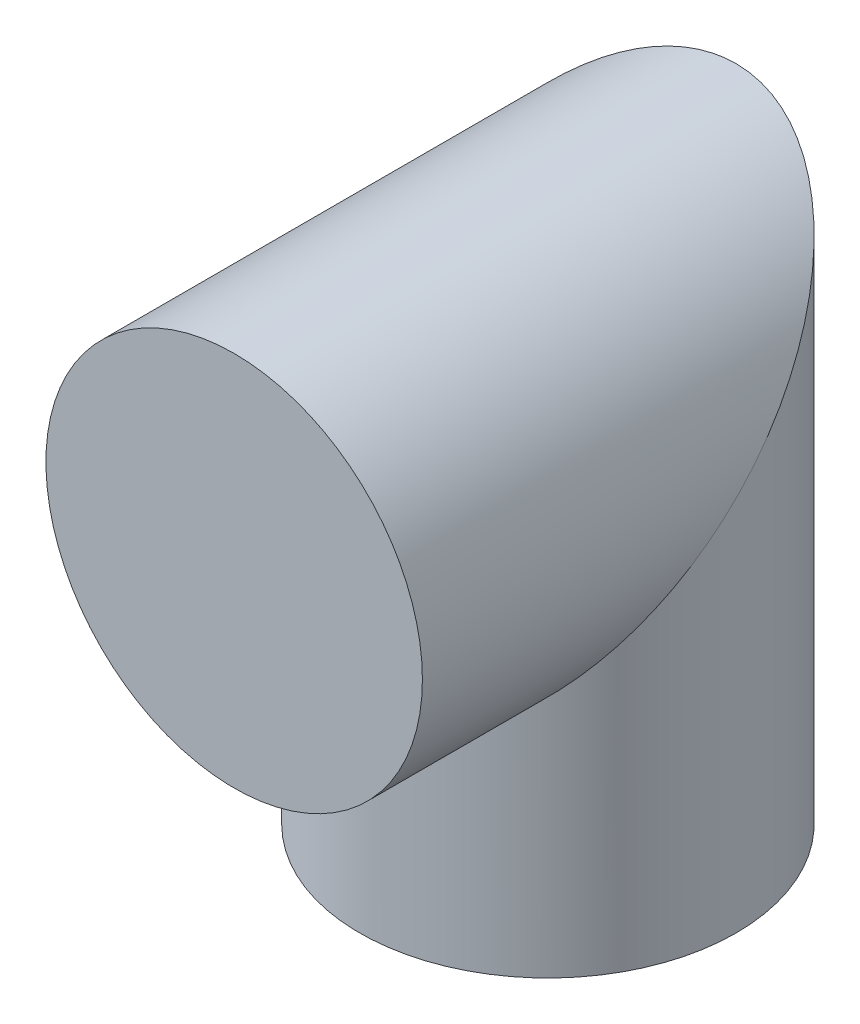
ISO-10303-21;
HEADER;
FILE_DESCRIPTION(('STEP AP214'),'2;1');
FILE_NAME('part.step','',(''),(''),'','','');
FILE_SCHEMA(('AUTOMOTIVE_DESIGN { 1 0 10303 214 1 1 1 1 }'));
ENDSEC;
DATA;
#1=APPLICATION_CONTEXT('core data for automotive mechanical design processes');
#2=APPLICATION_PROTOCOL_DEFINITION('international standard','automotive_design',2000,#1);
#3=PRODUCT_CONTEXT('',#1,'mechanical');
#4=PRODUCT('Part','Part','',(#3));
#5=PRODUCT_RELATED_PRODUCT_CATEGORY('part','',(#4));
#6=PRODUCT_DEFINITION_FORMATION('','',#4);
#7=PRODUCT_DEFINITION_CONTEXT('part definition',#1,'design');
#8=PRODUCT_DEFINITION('design','',#6,#7);
#9=PRODUCT_DEFINITION_SHAPE('','',#8);
#10=(LENGTH_UNIT() NAMED_UNIT(*) SI_UNIT(.MILLI.,.METRE.));
#11=(NAMED_UNIT(*) PLANE_ANGLE_UNIT() SI_UNIT($,.RADIAN.));
#12=(NAMED_UNIT(*) SI_UNIT($,.STERADIAN.) SOLID_ANGLE_UNIT());
#13=UNCERTAINTY_MEASURE_WITH_UNIT(LENGTH_MEASURE(1.E-05),#10,'distance_accuracy_value','');
#14=(GEOMETRIC_REPRESENTATION_CONTEXT(3) GLOBAL_UNCERTAINTY_ASSIGNED_CONTEXT((#13)) GLOBAL_UNIT_ASSIGNED_CONTEXT((#10,
#11,#12)) REPRESENTATION_CONTEXT('',''));
#15=CARTESIAN_POINT('',(0.,0.,0.));
#16=DIRECTION('',(0.,0.,1.));
#17=DIRECTION('',(1.,0.,0.));
#18=AXIS2_PLACEMENT_3D('',#15,#16,#17);
#19=CARTESIAN_POINT('',(0.,-60.,-50.));
#20=DIRECTION('',(0.,1.,0.));
#21=DIRECTION('',(1.,0.,0.));
#22=AXIS2_PLACEMENT_3D('',#19,#20,#21);
#23=PLANE('',#22);
#24=CARTESIAN_POINT('',(0.,-60.,-50.));
#25=DIRECTION('',(0.,1.,0.));
#26=DIRECTION('',(1.,0.,0.));
#27=AXIS2_PLACEMENT_3D('',#24,#25,#26);
#28=CIRCLE('',#27,30.);
#29=CARTESIAN_POINT('',(30.,-60.,-50.));
#30=VERTEX_POINT('',#29);
#31=EDGE_CURVE('E40',#30,#30,#28,.T.);
#32=ORIENTED_EDGE('',*,*,#31,.F.);
#33=EDGE_LOOP('',(#32));
#34=FACE_BOUND('',#33,.T.);
#35=ADVANCED_FACE('F37',(#34),#23,.F.);
#36=CARTESIAN_POINT('',(0.,0.,0.));
#37=DIRECTION('',(0.,0.,1.));
#38=DIRECTION('',(1.,0.,0.));
#39=AXIS2_PLACEMENT_3D('',#36,#37,#38);
#40=PLANE('',#39);
#41=CARTESIAN_POINT('',(0.,0.,0.));
#42=DIRECTION('',(0.,0.,1.));
#43=DIRECTION('',(1.,0.,0.));
#44=AXIS2_PLACEMENT_3D('',#41,#42,#43);
#45=CIRCLE('',#44,30.);
#46=CARTESIAN_POINT('',(30.,0.,0.));
#47=VERTEX_POINT('',#46);
#48=EDGE_CURVE('E45',#47,#47,#45,.T.);
#49=ORIENTED_EDGE('',*,*,#48,.T.);
#50=EDGE_LOOP('',(#49));
#51=FACE_BOUND('',#50,.T.);
#52=ADVANCED_FACE('F60',(#51),#40,.T.);
#53=CARTESIAN_POINT('',(0.,66.1,-50.));
#54=DIRECTION('',(0.,-1.,0.));
#55=DIRECTION('',(0.,0.,-1.));
#56=AXIS2_PLACEMENT_3D('',#53,#54,#55);
#57=CYLINDRICAL_SURFACE('',#56,30.);
#58=CARTESIAN_POINT('',(0.,0.,-50.));
#59=DIRECTION('',(0.,-0.707106781186547,-0.707106781186547));
#60=DIRECTION('',(0.,0.707106781186548,-0.707106781186548));
#61=AXIS2_PLACEMENT_3D('',#58,#59,#60);
#62=ELLIPSE('',#61,42.4264068711929,30.);
#63=CARTESIAN_POINT('',(0.,30.,-80.));
#64=VERTEX_POINT('',#63);
#65=EDGE_CURVE('E10',#64,#64,#62,.T.);
#66=ORIENTED_EDGE('',*,*,#65,.T.);
#67=EDGE_LOOP('',(#66));
#68=FACE_BOUND('',#67,.T.);
#69=ORIENTED_EDGE('',*,*,#31,.T.);
#70=EDGE_LOOP('',(#69));
#71=FACE_BOUND('',#70,.T.);
#72=ADVANCED_FACE('F57',(#68,#71),#57,.T.);
#73=CARTESIAN_POINT('',(0.,0.,0.));
#74=DIRECTION('',(0.,0.,-1.));
#75=DIRECTION('',(-1.,0.,0.));
#76=AXIS2_PLACEMENT_3D('',#73,#74,#75);
#77=CYLINDRICAL_SURFACE('',#76,30.);
#78=ORIENTED_EDGE('',*,*,#48,.F.);
#79=EDGE_LOOP('',(#78));
#80=FACE_BOUND('',#79,.T.);
#81=ORIENTED_EDGE('',*,*,#65,.F.);
#82=EDGE_LOOP('',(#81));
#83=FACE_BOUND('',#82,.T.);
#84=ADVANCED_FACE('F64',(#80,#83),#77,.T.);
#85=CLOSED_SHELL('',(#35,#52,#72,#84));
#86=MANIFOLD_SOLID_BREP('B2',#85);
#87=ADVANCED_BREP_SHAPE_REPRESENTATION('',(#18,#86),#14);
#88=SHAPE_DEFINITION_REPRESENTATION(#9,#87);
ENDSEC;
END-ISO-10303-21;
